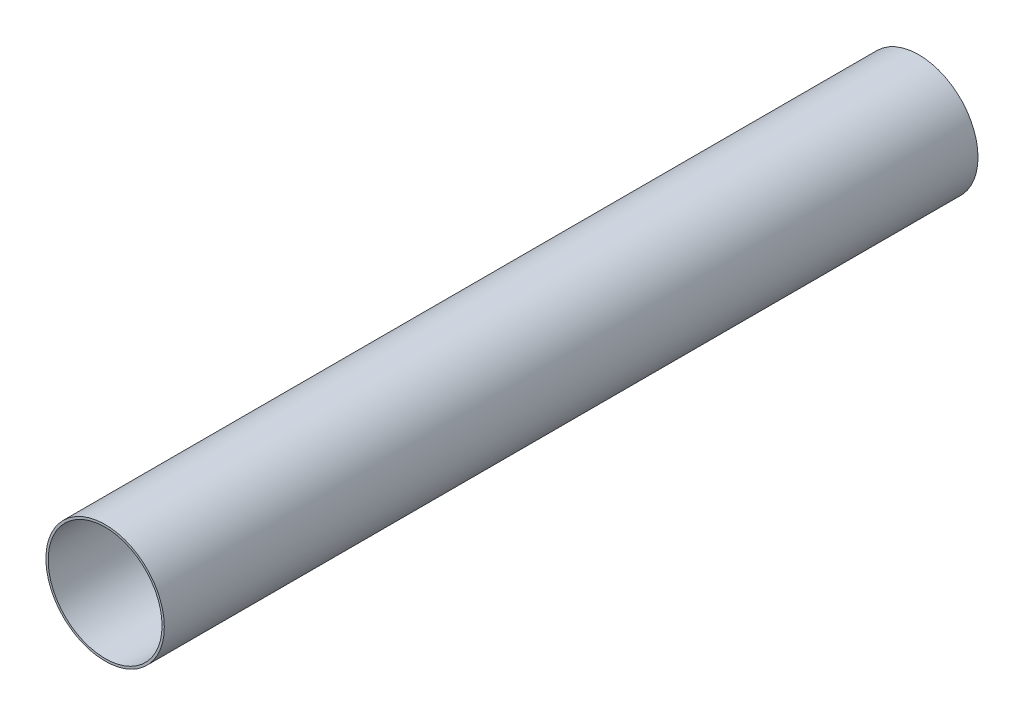
ISO-10303-21;
HEADER;
FILE_DESCRIPTION(('STEP AP214'),'2;1');
FILE_NAME('part.step','',(''),(''),'','','');
FILE_SCHEMA(('AUTOMOTIVE_DESIGN { 1 0 10303 214 1 1 1 1 }'));
ENDSEC;
DATA;
#1=APPLICATION_CONTEXT('core data for automotive mechanical design processes');
#2=APPLICATION_PROTOCOL_DEFINITION('international standard','automotive_design',2000,#1);
#3=PRODUCT_CONTEXT('',#1,'mechanical');
#4=PRODUCT('Part','Part','',(#3));
#5=PRODUCT_RELATED_PRODUCT_CATEGORY('part','',(#4));
#6=PRODUCT_DEFINITION_FORMATION('','',#4);
#7=PRODUCT_DEFINITION_CONTEXT('part definition',#1,'design');
#8=PRODUCT_DEFINITION('design','',#6,#7);
#9=PRODUCT_DEFINITION_SHAPE('','',#8);
#10=(LENGTH_UNIT() NAMED_UNIT(*) SI_UNIT(.MILLI.,.METRE.));
#11=(NAMED_UNIT(*) PLANE_ANGLE_UNIT() SI_UNIT($,.RADIAN.));
#12=(NAMED_UNIT(*) SI_UNIT($,.STERADIAN.) SOLID_ANGLE_UNIT());
#13=UNCERTAINTY_MEASURE_WITH_UNIT(LENGTH_MEASURE(1.E-05),#10,'distance_accuracy_value','');
#14=(GEOMETRIC_REPRESENTATION_CONTEXT(3) GLOBAL_UNCERTAINTY_ASSIGNED_CONTEXT((#13)) GLOBAL_UNIT_ASSIGNED_CONTEXT((#10,
#11,#12)) REPRESENTATION_CONTEXT('',''));
#15=CARTESIAN_POINT('',(0.,0.,0.));
#16=DIRECTION('',(0.,0.,1.));
#17=DIRECTION('',(1.,0.,0.));
#18=AXIS2_PLACEMENT_3D('',#15,#16,#17);
#19=CARTESIAN_POINT('',(0.,0.,544.5125));
#20=DIRECTION('',(0.,0.,1.));
#21=DIRECTION('',(1.,0.,0.));
#22=AXIS2_PLACEMENT_3D('',#19,#20,#21);
#23=PLANE('',#22);
#24=CARTESIAN_POINT('',(0.,0.,544.5125));
#25=DIRECTION('',(0.,0.,1.));
#26=DIRECTION('',(1.,0.,0.));
#27=AXIS2_PLACEMENT_3D('',#24,#25,#26);
#28=CIRCLE('',#27,39.624);
#29=CARTESIAN_POINT('',(39.624,0.,544.5125));
#30=VERTEX_POINT('',#29);
#31=EDGE_CURVE('E10',#30,#30,#28,.T.);
#32=ORIENTED_EDGE('',*,*,#31,.T.);
#33=EDGE_LOOP('',(#32));
#34=FACE_BOUND('',#33,.T.);
#35=CARTESIAN_POINT('',(0.,0.,544.5125));
#36=DIRECTION('',(0.,0.,1.));
#37=DIRECTION('',(1.,0.,0.));
#38=AXIS2_PLACEMENT_3D('',#35,#36,#37);
#39=CIRCLE('',#38,38.1);
#40=CARTESIAN_POINT('',(38.1,0.,544.5125));
#41=VERTEX_POINT('',#40);
#42=EDGE_CURVE('E46',#41,#41,#39,.T.);
#43=ORIENTED_EDGE('',*,*,#42,.F.);
#44=EDGE_LOOP('',(#43));
#45=FACE_BOUND('',#44,.T.);
#46=ADVANCED_FACE('F35',(#34,#45),#23,.T.);
#47=CARTESIAN_POINT('',(0.,0.,0.));
#48=DIRECTION('',(0.,0.,1.));
#49=DIRECTION('',(1.,0.,0.));
#50=AXIS2_PLACEMENT_3D('',#47,#48,#49);
#51=PLANE('',#50);
#52=CARTESIAN_POINT('',(0.,0.,0.));
#53=DIRECTION('',(0.,0.,1.));
#54=DIRECTION('',(1.,0.,0.));
#55=AXIS2_PLACEMENT_3D('',#52,#53,#54);
#56=CIRCLE('',#55,39.624);
#57=CARTESIAN_POINT('',(39.624,0.,0.));
#58=VERTEX_POINT('',#57);
#59=EDGE_CURVE('E39',#58,#58,#56,.T.);
#60=ORIENTED_EDGE('',*,*,#59,.F.);
#61=EDGE_LOOP('',(#60));
#62=FACE_BOUND('',#61,.T.);
#63=CARTESIAN_POINT('',(0.,0.,0.));
#64=DIRECTION('',(0.,0.,1.));
#65=DIRECTION('',(1.,0.,0.));
#66=AXIS2_PLACEMENT_3D('',#63,#64,#65);
#67=CIRCLE('',#66,38.1);
#68=CARTESIAN_POINT('',(38.1,0.,0.));
#69=VERTEX_POINT('',#68);
#70=EDGE_CURVE('E48',#69,#69,#67,.T.);
#71=ORIENTED_EDGE('',*,*,#70,.T.);
#72=EDGE_LOOP('',(#71));
#73=FACE_BOUND('',#72,.T.);
#74=ADVANCED_FACE('F58',(#62,#73),#51,.F.);
#75=CARTESIAN_POINT('',(0.,0.,544.5125));
#76=DIRECTION('',(0.,0.,-1.));
#77=DIRECTION('',(-1.,0.,0.));
#78=AXIS2_PLACEMENT_3D('',#75,#76,#77);
#79=CYLINDRICAL_SURFACE('',#78,39.624);
#80=ORIENTED_EDGE('',*,*,#31,.F.);
#81=EDGE_LOOP('',(#80));
#82=FACE_BOUND('',#81,.T.);
#83=ORIENTED_EDGE('',*,*,#59,.T.);
#84=EDGE_LOOP('',(#83));
#85=FACE_BOUND('',#84,.T.);
#86=ADVANCED_FACE('F37',(#82,#85),#79,.T.);
#87=CARTESIAN_POINT('',(0.,0.,544.5125));
#88=DIRECTION('',(0.,0.,-1.));
#89=DIRECTION('',(-1.,0.,0.));
#90=AXIS2_PLACEMENT_3D('',#87,#88,#89);
#91=CYLINDRICAL_SURFACE('',#90,38.1);
#92=ORIENTED_EDGE('',*,*,#42,.T.);
#93=EDGE_LOOP('',(#92));
#94=FACE_BOUND('',#93,.T.);
#95=ORIENTED_EDGE('',*,*,#70,.F.);
#96=EDGE_LOOP('',(#95));
#97=FACE_BOUND('',#96,.T.);
#98=ADVANCED_FACE('F54',(#94,#97),#91,.F.);
#99=CLOSED_SHELL('',(#46,#74,#86,#98));
#100=MANIFOLD_SOLID_BREP('B2',#99);
#101=ADVANCED_BREP_SHAPE_REPRESENTATION('',(#18,#100),#14);
#102=SHAPE_DEFINITION_REPRESENTATION(#9,#101);
ENDSEC;
END-ISO-10303-21;
